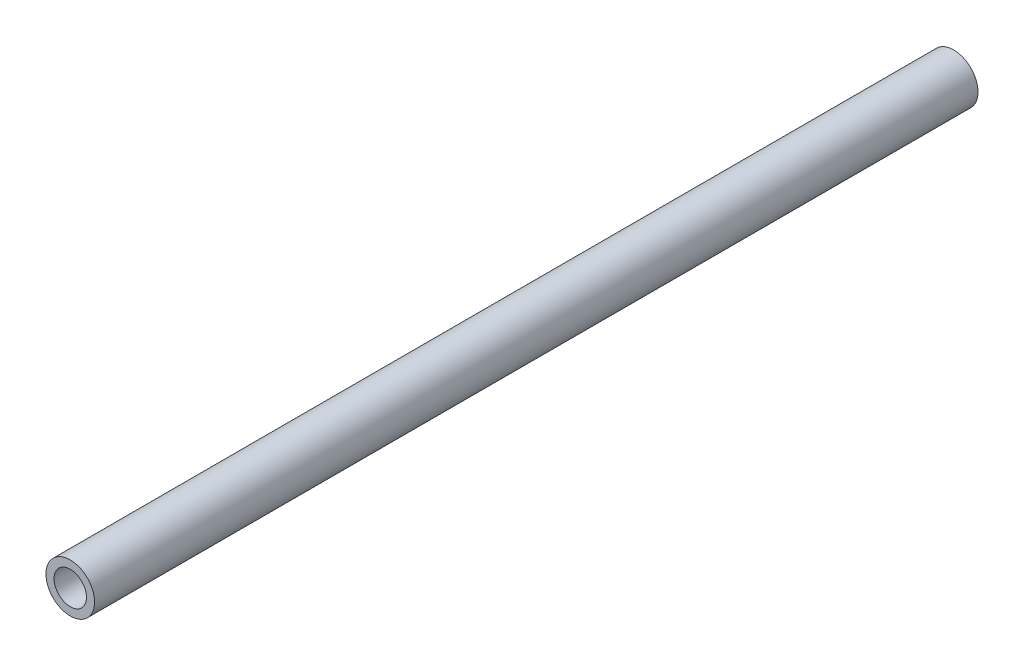
ISO-10303-21;
HEADER;
FILE_DESCRIPTION(('STEP AP214'),'2;1');
FILE_NAME('part.step','',(''),(''),'','','');
FILE_SCHEMA(('AUTOMOTIVE_DESIGN { 1 0 10303 214 1 1 1 1 }'));
ENDSEC;
DATA;
#1=APPLICATION_CONTEXT('core data for automotive mechanical design processes');
#2=APPLICATION_PROTOCOL_DEFINITION('international standard','automotive_design',2000,#1);
#3=PRODUCT_CONTEXT('',#1,'mechanical');
#4=PRODUCT('Part','Part','',(#3));
#5=PRODUCT_RELATED_PRODUCT_CATEGORY('part','',(#4));
#6=PRODUCT_DEFINITION_FORMATION('','',#4);
#7=PRODUCT_DEFINITION_CONTEXT('part definition',#1,'design');
#8=PRODUCT_DEFINITION('design','',#6,#7);
#9=PRODUCT_DEFINITION_SHAPE('','',#8);
#10=(LENGTH_UNIT() NAMED_UNIT(*) SI_UNIT(.MILLI.,.METRE.));
#11=(NAMED_UNIT(*) PLANE_ANGLE_UNIT() SI_UNIT($,.RADIAN.));
#12=(NAMED_UNIT(*) SI_UNIT($,.STERADIAN.) SOLID_ANGLE_UNIT());
#13=UNCERTAINTY_MEASURE_WITH_UNIT(LENGTH_MEASURE(1.E-05),#10,'distance_accuracy_value','');
#14=(GEOMETRIC_REPRESENTATION_CONTEXT(3) GLOBAL_UNCERTAINTY_ASSIGNED_CONTEXT((#13)) GLOBAL_UNIT_ASSIGNED_CONTEXT((#10,
#11,#12)) REPRESENTATION_CONTEXT('',''));
#15=CARTESIAN_POINT('',(0.,0.,0.));
#16=DIRECTION('',(0.,0.,1.));
#17=DIRECTION('',(1.,0.,0.));
#18=AXIS2_PLACEMENT_3D('',#15,#16,#17);
#19=CARTESIAN_POINT('',(0.,0.,109.));
#20=DIRECTION('',(0.,0.,1.));
#21=DIRECTION('',(1.,0.,0.));
#22=AXIS2_PLACEMENT_3D('',#19,#20,#21);
#23=PLANE('',#22);
#24=CARTESIAN_POINT('',(0.,0.,109.));
#25=DIRECTION('',(0.,0.,1.));
#26=DIRECTION('',(1.,0.,0.));
#27=AXIS2_PLACEMENT_3D('',#24,#25,#26);
#28=CIRCLE('',#27,3.);
#29=CARTESIAN_POINT('',(3.,0.,109.));
#30=VERTEX_POINT('',#29);
#31=EDGE_CURVE('E10',#30,#30,#28,.T.);
#32=ORIENTED_EDGE('',*,*,#31,.T.);
#33=EDGE_LOOP('',(#32));
#34=FACE_BOUND('',#33,.T.);
#35=CARTESIAN_POINT('',(0.,0.,109.));
#36=DIRECTION('',(0.,0.,1.));
#37=DIRECTION('',(1.,0.,0.));
#38=AXIS2_PLACEMENT_3D('',#35,#36,#37);
#39=CIRCLE('',#38,2.);
#40=CARTESIAN_POINT('',(2.,0.,109.));
#41=VERTEX_POINT('',#40);
#42=EDGE_CURVE('E42',#41,#41,#39,.T.);
#43=ORIENTED_EDGE('',*,*,#42,.F.);
#44=EDGE_LOOP('',(#43));
#45=FACE_BOUND('',#44,.T.);
#46=ADVANCED_FACE('F31',(#34,#45),#23,.T.);
#47=CARTESIAN_POINT('',(0.,0.,0.));
#48=DIRECTION('',(0.,0.,1.));
#49=DIRECTION('',(1.,0.,0.));
#50=AXIS2_PLACEMENT_3D('',#47,#48,#49);
#51=PLANE('',#50);
#52=CARTESIAN_POINT('',(0.,0.,0.));
#53=DIRECTION('',(0.,0.,1.));
#54=DIRECTION('',(1.,0.,0.));
#55=AXIS2_PLACEMENT_3D('',#52,#53,#54);
#56=CIRCLE('',#55,3.);
#57=CARTESIAN_POINT('',(3.,0.,0.));
#58=VERTEX_POINT('',#57);
#59=EDGE_CURVE('E35',#58,#58,#56,.T.);
#60=ORIENTED_EDGE('',*,*,#59,.F.);
#61=EDGE_LOOP('',(#60));
#62=FACE_BOUND('',#61,.T.);
#63=CARTESIAN_POINT('',(0.,0.,0.));
#64=DIRECTION('',(0.,0.,1.));
#65=DIRECTION('',(1.,0.,0.));
#66=AXIS2_PLACEMENT_3D('',#63,#64,#65);
#67=CIRCLE('',#66,2.);
#68=CARTESIAN_POINT('',(2.,0.,0.));
#69=VERTEX_POINT('',#68);
#70=EDGE_CURVE('E44',#69,#69,#67,.T.);
#71=ORIENTED_EDGE('',*,*,#70,.T.);
#72=EDGE_LOOP('',(#71));
#73=FACE_BOUND('',#72,.T.);
#74=ADVANCED_FACE('F54',(#62,#73),#51,.F.);
#75=CARTESIAN_POINT('',(0.,0.,109.));
#76=DIRECTION('',(0.,0.,-1.));
#77=DIRECTION('',(-1.,0.,0.));
#78=AXIS2_PLACEMENT_3D('',#75,#76,#77);
#79=CYLINDRICAL_SURFACE('',#78,3.);
#80=ORIENTED_EDGE('',*,*,#31,.F.);
#81=EDGE_LOOP('',(#80));
#82=FACE_BOUND('',#81,.T.);
#83=ORIENTED_EDGE('',*,*,#59,.T.);
#84=EDGE_LOOP('',(#83));
#85=FACE_BOUND('',#84,.T.);
#86=ADVANCED_FACE('F33',(#82,#85),#79,.T.);
#87=CARTESIAN_POINT('',(0.,0.,109.));
#88=DIRECTION('',(0.,0.,-1.));
#89=DIRECTION('',(-1.,0.,0.));
#90=AXIS2_PLACEMENT_3D('',#87,#88,#89);
#91=CYLINDRICAL_SURFACE('',#90,2.);
#92=ORIENTED_EDGE('',*,*,#42,.T.);
#93=EDGE_LOOP('',(#92));
#94=FACE_BOUND('',#93,.T.);
#95=ORIENTED_EDGE('',*,*,#70,.F.);
#96=EDGE_LOOP('',(#95));
#97=FACE_BOUND('',#96,.T.);
#98=ADVANCED_FACE('F50',(#94,#97),#91,.F.);
#99=CLOSED_SHELL('',(#46,#74,#86,#98));
#100=MANIFOLD_SOLID_BREP('B2',#99);
#101=ADVANCED_BREP_SHAPE_REPRESENTATION('',(#18,#100),#14);
#102=SHAPE_DEFINITION_REPRESENTATION(#9,#101);
ENDSEC;
END-ISO-10303-21;
